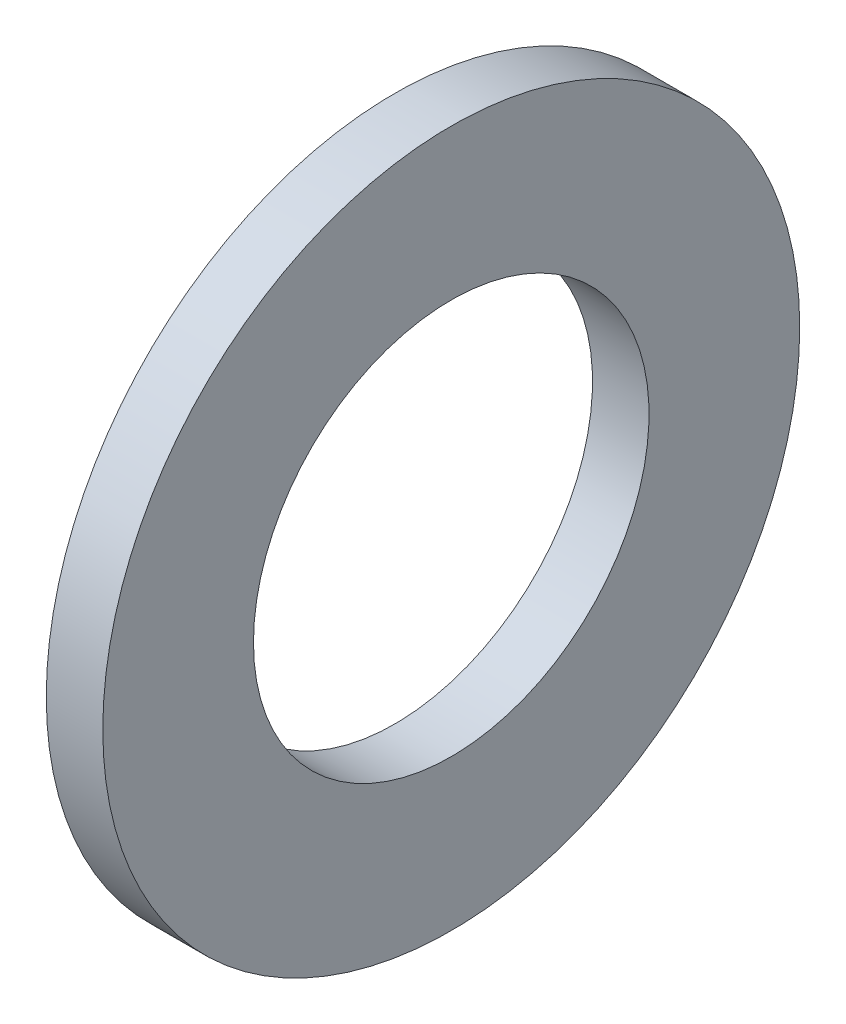
ISO-10303-21;
HEADER;
FILE_DESCRIPTION(('STEP AP214'),'2;1');
FILE_NAME('part.step','',(''),(''),'','','');
FILE_SCHEMA(('AUTOMOTIVE_DESIGN { 1 0 10303 214 1 1 1 1 }'));
ENDSEC;
DATA;
#1=APPLICATION_CONTEXT('core data for automotive mechanical design processes');
#2=APPLICATION_PROTOCOL_DEFINITION('international standard','automotive_design',2000,#1);
#3=PRODUCT_CONTEXT('',#1,'mechanical');
#4=PRODUCT('Part','Part','',(#3));
#5=PRODUCT_RELATED_PRODUCT_CATEGORY('part','',(#4));
#6=PRODUCT_DEFINITION_FORMATION('','',#4);
#7=PRODUCT_DEFINITION_CONTEXT('part definition',#1,'design');
#8=PRODUCT_DEFINITION('design','',#6,#7);
#9=PRODUCT_DEFINITION_SHAPE('','',#8);
#10=(LENGTH_UNIT() NAMED_UNIT(*) SI_UNIT(.MILLI.,.METRE.));
#11=(NAMED_UNIT(*) PLANE_ANGLE_UNIT() SI_UNIT($,.RADIAN.));
#12=(NAMED_UNIT(*) SI_UNIT($,.STERADIAN.) SOLID_ANGLE_UNIT());
#13=UNCERTAINTY_MEASURE_WITH_UNIT(LENGTH_MEASURE(1.E-05),#10,'distance_accuracy_value','');
#14=(GEOMETRIC_REPRESENTATION_CONTEXT(3) GLOBAL_UNCERTAINTY_ASSIGNED_CONTEXT((#13)) GLOBAL_UNIT_ASSIGNED_CONTEXT((#10,
#11,#12)) REPRESENTATION_CONTEXT('',''));
#15=CARTESIAN_POINT('',(0.,0.,0.));
#16=DIRECTION('',(0.,0.,1.));
#17=DIRECTION('',(1.,0.,0.));
#18=AXIS2_PLACEMENT_3D('',#15,#16,#17);
#19=CARTESIAN_POINT('',(-34.9249999999999,0.,0.));
#20=DIRECTION('',(-1.,0.,0.));
#21=DIRECTION('',(0.,0.,1.));
#22=AXIS2_PLACEMENT_3D('',#19,#20,#21);
#23=CYLINDRICAL_SURFACE('',#22,10.5);
#24=CARTESIAN_POINT('',(0.,0.,0.));
#25=DIRECTION('',(-1.,0.,0.));
#26=DIRECTION('',(0.,0.,1.));
#27=AXIS2_PLACEMENT_3D('',#24,#25,#26);
#28=CIRCLE('',#27,10.5);
#29=CARTESIAN_POINT('',(0.,0.,10.5));
#30=VERTEX_POINT('',#29);
#31=EDGE_CURVE('E10',#30,#30,#28,.T.);
#32=ORIENTED_EDGE('',*,*,#31,.F.);
#33=EDGE_LOOP('',(#32));
#34=FACE_BOUND('',#33,.T.);
#35=CARTESIAN_POINT('',(-3.,0.,0.));
#36=DIRECTION('',(-1.,0.,0.));
#37=DIRECTION('',(0.,0.,1.));
#38=AXIS2_PLACEMENT_3D('',#35,#36,#37);
#39=CIRCLE('',#38,10.5);
#40=CARTESIAN_POINT('',(-3.,0.,10.5));
#41=VERTEX_POINT('',#40);
#42=EDGE_CURVE('E44',#41,#41,#39,.T.);
#43=ORIENTED_EDGE('',*,*,#42,.T.);
#44=EDGE_LOOP('',(#43));
#45=FACE_BOUND('',#44,.T.);
#46=ADVANCED_FACE('F30',(#34,#45),#23,.F.);
#47=CARTESIAN_POINT('',(0.,10.5,0.));
#48=DIRECTION('',(-1.,0.,0.));
#49=DIRECTION('',(0.,0.,1.));
#50=AXIS2_PLACEMENT_3D('',#47,#48,#49);
#51=PLANE('',#50);
#52=CARTESIAN_POINT('',(0.,0.,0.));
#53=DIRECTION('',(-1.,0.,0.));
#54=DIRECTION('',(0.,0.,1.));
#55=AXIS2_PLACEMENT_3D('',#52,#53,#54);
#56=CIRCLE('',#55,18.5);
#57=CARTESIAN_POINT('',(0.,0.,18.5));
#58=VERTEX_POINT('',#57);
#59=EDGE_CURVE('E36',#58,#58,#56,.T.);
#60=ORIENTED_EDGE('',*,*,#59,.F.);
#61=EDGE_LOOP('',(#60));
#62=FACE_BOUND('',#61,.T.);
#63=ORIENTED_EDGE('',*,*,#31,.T.);
#64=EDGE_LOOP('',(#63));
#65=FACE_BOUND('',#64,.T.);
#66=ADVANCED_FACE('F59',(#62,#65),#51,.F.);
#67=CARTESIAN_POINT('',(-34.9249999999999,0.,0.));
#68=DIRECTION('',(-1.,0.,0.));
#69=DIRECTION('',(0.,0.,1.));
#70=AXIS2_PLACEMENT_3D('',#67,#68,#69);
#71=CYLINDRICAL_SURFACE('',#70,18.5);
#72=CARTESIAN_POINT('',(-3.,0.,0.));
#73=DIRECTION('',(-1.,0.,0.));
#74=DIRECTION('',(0.,0.,1.));
#75=AXIS2_PLACEMENT_3D('',#72,#73,#74);
#76=CIRCLE('',#75,18.5);
#77=CARTESIAN_POINT('',(-3.,0.,18.5));
#78=VERTEX_POINT('',#77);
#79=EDGE_CURVE('E40',#78,#78,#76,.T.);
#80=ORIENTED_EDGE('',*,*,#79,.F.);
#81=EDGE_LOOP('',(#80));
#82=FACE_BOUND('',#81,.T.);
#83=ORIENTED_EDGE('',*,*,#59,.T.);
#84=EDGE_LOOP('',(#83));
#85=FACE_BOUND('',#84,.T.);
#86=ADVANCED_FACE('F54',(#82,#85),#71,.T.);
#87=CARTESIAN_POINT('',(-3.,18.5,0.));
#88=DIRECTION('',(1.,0.,0.));
#89=DIRECTION('',(0.,0.,-1.));
#90=AXIS2_PLACEMENT_3D('',#87,#88,#89);
#91=PLANE('',#90);
#92=ORIENTED_EDGE('',*,*,#42,.F.);
#93=EDGE_LOOP('',(#92));
#94=FACE_BOUND('',#93,.T.);
#95=ORIENTED_EDGE('',*,*,#79,.T.);
#96=EDGE_LOOP('',(#95));
#97=FACE_BOUND('',#96,.T.);
#98=ADVANCED_FACE('F51',(#94,#97),#91,.F.);
#99=CLOSED_SHELL('',(#46,#66,#86,#98));
#100=MANIFOLD_SOLID_BREP('B2',#99);
#101=ADVANCED_BREP_SHAPE_REPRESENTATION('',(#18,#100),#14);
#102=SHAPE_DEFINITION_REPRESENTATION(#9,#101);
ENDSEC;
END-ISO-10303-21;
